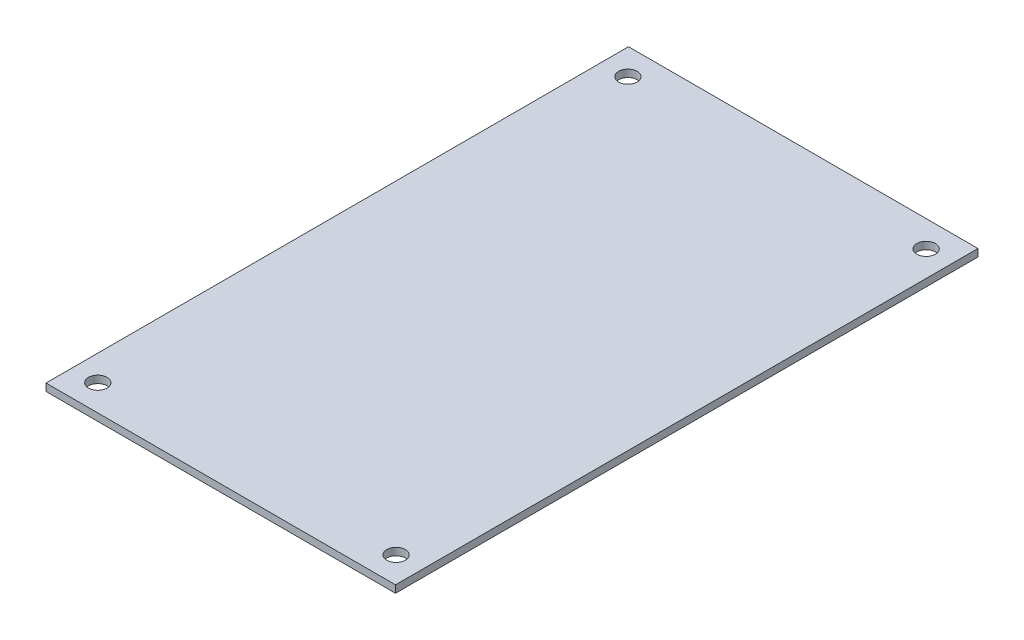
ISO-10303-21;
HEADER;
FILE_DESCRIPTION(('STEP AP214'),'2;1');
FILE_NAME('part.step','',(''),(''),'','','');
FILE_SCHEMA(('AUTOMOTIVE_DESIGN { 1 0 10303 214 1 1 1 1 }'));
ENDSEC;
DATA;
#1=APPLICATION_CONTEXT('core data for automotive mechanical design processes');
#2=APPLICATION_PROTOCOL_DEFINITION('international standard','automotive_design',2000,#1);
#3=PRODUCT_CONTEXT('',#1,'mechanical');
#4=PRODUCT('Part','Part','',(#3));
#5=PRODUCT_RELATED_PRODUCT_CATEGORY('part','',(#4));
#6=PRODUCT_DEFINITION_FORMATION('','',#4);
#7=PRODUCT_DEFINITION_CONTEXT('part definition',#1,'design');
#8=PRODUCT_DEFINITION('design','',#6,#7);
#9=PRODUCT_DEFINITION_SHAPE('','',#8);
#10=(LENGTH_UNIT() NAMED_UNIT(*) SI_UNIT(.MILLI.,.METRE.));
#11=(NAMED_UNIT(*) PLANE_ANGLE_UNIT() SI_UNIT($,.RADIAN.));
#12=(NAMED_UNIT(*) SI_UNIT($,.STERADIAN.) SOLID_ANGLE_UNIT());
#13=UNCERTAINTY_MEASURE_WITH_UNIT(LENGTH_MEASURE(1.E-05),#10,'distance_accuracy_value','');
#14=(GEOMETRIC_REPRESENTATION_CONTEXT(3) GLOBAL_UNCERTAINTY_ASSIGNED_CONTEXT((#13)) GLOBAL_UNIT_ASSIGNED_CONTEXT((#10,
#11,#12)) REPRESENTATION_CONTEXT('',''));
#15=CARTESIAN_POINT('',(0.,0.,0.));
#16=DIRECTION('',(0.,0.,1.));
#17=DIRECTION('',(1.,0.,0.));
#18=AXIS2_PLACEMENT_3D('',#15,#16,#17);
#19=CARTESIAN_POINT('',(38.0100000000001,-22.7500000000002,-0.00500000000001888));
#20=DIRECTION('',(0.,-1.,0.));
#21=DIRECTION('',(0.,0.,-1.));
#22=AXIS2_PLACEMENT_3D('',#19,#20,#21);
#23=PLANE('',#22);
#24=CARTESIAN_POINT('',(-32.6,-22.7500000000002,121.285));
#25=DIRECTION('',(0.,-1.,0.));
#26=DIRECTION('',(-1.,0.,0.));
#27=AXIS2_PLACEMENT_3D('',#24,#25,#26);
#28=CIRCLE('',#27,2.02500000000005);
#29=CARTESIAN_POINT('',(-34.625,-22.7500000000002,121.285));
#30=VERTEX_POINT('',#29);
#31=EDGE_CURVE('E93',#30,#30,#28,.T.);
#32=ORIENTED_EDGE('',*,*,#31,.F.);
#33=EDGE_LOOP('',(#32));
#34=FACE_BOUND('',#33,.T.);
#35=CARTESIAN_POINT('',(-32.6,-22.7500000000002,5.71499999999998));
#36=DIRECTION('',(0.,-1.,0.));
#37=DIRECTION('',(-1.,0.,0.));
#38=AXIS2_PLACEMENT_3D('',#35,#36,#37);
#39=CIRCLE('',#38,2.025);
#40=CARTESIAN_POINT('',(-34.625,-22.7500000000002,5.71499999999998));
#41=VERTEX_POINT('',#40);
#42=EDGE_CURVE('E95',#41,#41,#39,.T.);
#43=ORIENTED_EDGE('',*,*,#42,.F.);
#44=EDGE_LOOP('',(#43));
#45=FACE_BOUND('',#44,.T.);
#46=CARTESIAN_POINT('',(32.42,-22.7500000000002,5.71499999999998));
#47=DIRECTION('',(0.,-1.,0.));
#48=DIRECTION('',(-1.,0.,0.));
#49=AXIS2_PLACEMENT_3D('',#46,#47,#48);
#50=CIRCLE('',#49,2.025);
#51=CARTESIAN_POINT('',(30.395,-22.7500000000002,5.71499999999998));
#52=VERTEX_POINT('',#51);
#53=EDGE_CURVE('E109',#52,#52,#50,.T.);
#54=ORIENTED_EDGE('',*,*,#53,.F.);
#55=EDGE_LOOP('',(#54));
#56=FACE_BOUND('',#55,.T.);
#57=CARTESIAN_POINT('',(32.42,-22.7500000000002,121.285));
#58=DIRECTION('',(0.,-1.,0.));
#59=DIRECTION('',(-1.,0.,0.));
#60=AXIS2_PLACEMENT_3D('',#57,#58,#59);
#61=CIRCLE('',#60,2.02500000000005);
#62=CARTESIAN_POINT('',(30.395,-22.7500000000002,121.285));
#63=VERTEX_POINT('',#62);
#64=EDGE_CURVE('E112',#63,#63,#61,.T.);
#65=ORIENTED_EDGE('',*,*,#64,.F.);
#66=EDGE_LOOP('',(#65));
#67=FACE_BOUND('',#66,.T.);
#68=DIRECTION('',(1.,0.,0.));
#69=VECTOR('',#68,1.);
#70=CARTESIAN_POINT('',(-38.1899999999999,-22.7500000000002,-0.00500000000001888));
#71=LINE('',#70,#69);
#72=CARTESIAN_POINT('',(-38.1899999999999,-22.7500000000002,-0.00500000000001888));
#73=VERTEX_POINT('',#72);
#74=CARTESIAN_POINT('',(38.0100000000001,-22.7500000000002,-0.00500000000001888));
#75=VERTEX_POINT('',#74);
#76=EDGE_CURVE('E11',#73,#75,#71,.T.);
#77=ORIENTED_EDGE('',*,*,#76,.T.);
#78=DIRECTION('',(0.,0.,1.));
#79=VECTOR('',#78,1.);
#80=CARTESIAN_POINT('',(38.0100000000001,-22.7500000000002,-0.00500000000001888));
#81=LINE('',#80,#79);
#82=CARTESIAN_POINT('',(38.0100000000001,-22.7500000000002,126.995));
#83=VERTEX_POINT('',#82);
#84=EDGE_CURVE('E27',#75,#83,#81,.T.);
#85=ORIENTED_EDGE('',*,*,#84,.T.);
#86=DIRECTION('',(-1.,0.,0.));
#87=VECTOR('',#86,1.);
#88=CARTESIAN_POINT('',(38.0100000000001,-22.7500000000002,126.995));
#89=LINE('',#88,#87);
#90=CARTESIAN_POINT('',(-38.1899999999999,-22.7500000000002,126.995));
#91=VERTEX_POINT('',#90);
#92=EDGE_CURVE('E80',#83,#91,#89,.T.);
#93=ORIENTED_EDGE('',*,*,#92,.T.);
#94=DIRECTION('',(0.,0.,-1.));
#95=VECTOR('',#94,1.);
#96=CARTESIAN_POINT('',(-38.1899999999999,-22.7500000000002,126.995));
#97=LINE('',#96,#95);
#98=EDGE_CURVE('E84',#91,#73,#97,.T.);
#99=ORIENTED_EDGE('',*,*,#98,.T.);
#100=EDGE_LOOP('',(#77,#85,#93,#99));
#101=FACE_BOUND('',#100,.T.);
#102=ADVANCED_FACE('F17',(#34,#45,#56,#67,#101),#23,.T.);
#103=CARTESIAN_POINT('',(38.0100000000001,-21.1500000000002,-0.00500000000001888));
#104=DIRECTION('',(0.,1.,0.));
#105=DIRECTION('',(0.,0.,1.));
#106=AXIS2_PLACEMENT_3D('',#103,#104,#105);
#107=PLANE('',#106);
#108=CARTESIAN_POINT('',(-32.6,-21.1500000000002,121.285));
#109=DIRECTION('',(0.,-1.,0.));
#110=DIRECTION('',(-1.,0.,0.));
#111=AXIS2_PLACEMENT_3D('',#108,#109,#110);
#112=CIRCLE('',#111,2.02500000000005);
#113=CARTESIAN_POINT('',(-34.625,-21.1500000000002,121.285));
#114=VERTEX_POINT('',#113);
#115=EDGE_CURVE('E91',#114,#114,#112,.T.);
#116=ORIENTED_EDGE('',*,*,#115,.T.);
#117=EDGE_LOOP('',(#116));
#118=FACE_BOUND('',#117,.T.);
#119=CARTESIAN_POINT('',(-32.6,-21.1500000000002,5.71499999999998));
#120=DIRECTION('',(0.,-1.,0.));
#121=DIRECTION('',(-1.,0.,0.));
#122=AXIS2_PLACEMENT_3D('',#119,#120,#121);
#123=CIRCLE('',#122,2.025);
#124=CARTESIAN_POINT('',(-34.625,-21.1500000000002,5.71499999999998));
#125=VERTEX_POINT('',#124);
#126=EDGE_CURVE('E96',#125,#125,#123,.T.);
#127=ORIENTED_EDGE('',*,*,#126,.T.);
#128=EDGE_LOOP('',(#127));
#129=FACE_BOUND('',#128,.T.);
#130=CARTESIAN_POINT('',(32.42,-21.1500000000002,5.71499999999998));
#131=DIRECTION('',(0.,-1.,0.));
#132=DIRECTION('',(-1.,0.,0.));
#133=AXIS2_PLACEMENT_3D('',#130,#131,#132);
#134=CIRCLE('',#133,2.025);
#135=CARTESIAN_POINT('',(30.395,-21.1500000000002,5.71499999999998));
#136=VERTEX_POINT('',#135);
#137=EDGE_CURVE('E98',#136,#136,#134,.T.);
#138=ORIENTED_EDGE('',*,*,#137,.T.);
#139=EDGE_LOOP('',(#138));
#140=FACE_BOUND('',#139,.T.);
#141=CARTESIAN_POINT('',(32.42,-21.1500000000002,121.285));
#142=DIRECTION('',(0.,-1.,0.));
#143=DIRECTION('',(-1.,0.,0.));
#144=AXIS2_PLACEMENT_3D('',#141,#142,#143);
#145=CIRCLE('',#144,2.02500000000005);
#146=CARTESIAN_POINT('',(30.395,-21.1500000000002,121.285));
#147=VERTEX_POINT('',#146);
#148=EDGE_CURVE('E76',#147,#147,#145,.T.);
#149=ORIENTED_EDGE('',*,*,#148,.T.);
#150=EDGE_LOOP('',(#149));
#151=FACE_BOUND('',#150,.T.);
#152=DIRECTION('',(1.,0.,0.));
#153=VECTOR('',#152,1.);
#154=CARTESIAN_POINT('',(-38.1899999999999,-21.1500000000002,-0.00500000000001888));
#155=LINE('',#154,#153);
#156=CARTESIAN_POINT('',(-38.1899999999999,-21.1500000000002,-0.00500000000001888));
#157=VERTEX_POINT('',#156);
#158=CARTESIAN_POINT('',(38.0100000000001,-21.1500000000002,-0.00500000000001888));
#159=VERTEX_POINT('',#158);
#160=EDGE_CURVE('E21',#157,#159,#155,.T.);
#161=ORIENTED_EDGE('',*,*,#160,.F.);
#162=DIRECTION('',(0.,0.,-1.));
#163=VECTOR('',#162,1.);
#164=CARTESIAN_POINT('',(-38.1899999999999,-21.1500000000002,126.995));
#165=LINE('',#164,#163);
#166=CARTESIAN_POINT('',(-38.1899999999999,-21.1500000000002,126.995));
#167=VERTEX_POINT('',#166);
#168=EDGE_CURVE('E68',#167,#157,#165,.T.);
#169=ORIENTED_EDGE('',*,*,#168,.F.);
#170=DIRECTION('',(-1.,0.,0.));
#171=VECTOR('',#170,1.);
#172=CARTESIAN_POINT('',(38.0100000000001,-21.1500000000002,126.995));
#173=LINE('',#172,#171);
#174=CARTESIAN_POINT('',(38.0100000000001,-21.1500000000002,126.995));
#175=VERTEX_POINT('',#174);
#176=EDGE_CURVE('E63',#175,#167,#173,.T.);
#177=ORIENTED_EDGE('',*,*,#176,.F.);
#178=DIRECTION('',(0.,0.,1.));
#179=VECTOR('',#178,1.);
#180=CARTESIAN_POINT('',(38.0100000000001,-21.1500000000002,-0.00500000000001888));
#181=LINE('',#180,#179);
#182=EDGE_CURVE('E67',#159,#175,#181,.T.);
#183=ORIENTED_EDGE('',*,*,#182,.F.);
#184=EDGE_LOOP('',(#161,#169,#177,#183));
#185=FACE_BOUND('',#184,.T.);
#186=ADVANCED_FACE('F66',(#118,#129,#140,#151,#185),#107,.T.);
#187=CARTESIAN_POINT('',(38.0100000000001,-21.1500000000002,-0.00500000000001888));
#188=DIRECTION('',(1.,0.,0.));
#189=DIRECTION('',(0.,0.,-1.));
#190=AXIS2_PLACEMENT_3D('',#187,#188,#189);
#191=PLANE('',#190);
#192=ORIENTED_EDGE('',*,*,#84,.F.);
#193=DIRECTION('',(0.,-1.,0.));
#194=VECTOR('',#193,1.);
#195=CARTESIAN_POINT('',(38.0100000000001,-21.1500000000002,-0.00500000000001888));
#196=LINE('',#195,#194);
#197=EDGE_CURVE('E36',#159,#75,#196,.T.);
#198=ORIENTED_EDGE('',*,*,#197,.F.);
#199=ORIENTED_EDGE('',*,*,#182,.T.);
#200=DIRECTION('',(0.,-1.,0.));
#201=VECTOR('',#200,1.);
#202=CARTESIAN_POINT('',(38.0100000000001,-21.1500000000002,126.995));
#203=LINE('',#202,#201);
#204=EDGE_CURVE('E71',#175,#83,#203,.T.);
#205=ORIENTED_EDGE('',*,*,#204,.T.);
#206=EDGE_LOOP('',(#192,#198,#199,#205));
#207=FACE_BOUND('',#206,.T.);
#208=ADVANCED_FACE('F75',(#207),#191,.T.);
#209=CARTESIAN_POINT('',(38.0100000000001,-21.1500000000002,126.995));
#210=DIRECTION('',(0.,0.,1.));
#211=DIRECTION('',(1.,0.,0.));
#212=AXIS2_PLACEMENT_3D('',#209,#210,#211);
#213=PLANE('',#212);
#214=ORIENTED_EDGE('',*,*,#92,.F.);
#215=ORIENTED_EDGE('',*,*,#204,.F.);
#216=ORIENTED_EDGE('',*,*,#176,.T.);
#217=DIRECTION('',(0.,-1.,0.));
#218=VECTOR('',#217,1.);
#219=CARTESIAN_POINT('',(-38.1899999999999,-21.1500000000002,126.995));
#220=LINE('',#219,#218);
#221=EDGE_CURVE('E56',#167,#91,#220,.T.);
#222=ORIENTED_EDGE('',*,*,#221,.T.);
#223=EDGE_LOOP('',(#214,#215,#216,#222));
#224=FACE_BOUND('',#223,.T.);
#225=ADVANCED_FACE('F78',(#224),#213,.T.);
#226=CARTESIAN_POINT('',(-38.1899999999999,-21.1500000000002,126.995));
#227=DIRECTION('',(-1.,0.,0.));
#228=DIRECTION('',(0.,0.,1.));
#229=AXIS2_PLACEMENT_3D('',#226,#227,#228);
#230=PLANE('',#229);
#231=ORIENTED_EDGE('',*,*,#98,.F.);
#232=ORIENTED_EDGE('',*,*,#221,.F.);
#233=ORIENTED_EDGE('',*,*,#168,.T.);
#234=DIRECTION('',(0.,-1.,0.));
#235=VECTOR('',#234,1.);
#236=CARTESIAN_POINT('',(-38.1899999999999,-21.1500000000002,-0.00500000000001888));
#237=LINE('',#236,#235);
#238=EDGE_CURVE('E50',#157,#73,#237,.T.);
#239=ORIENTED_EDGE('',*,*,#238,.T.);
#240=EDGE_LOOP('',(#231,#232,#233,#239));
#241=FACE_BOUND('',#240,.T.);
#242=ADVANCED_FACE('F129',(#241),#230,.T.);
#243=CARTESIAN_POINT('',(-38.1899999999999,-21.1500000000002,-0.00500000000001888));
#244=DIRECTION('',(0.,0.,-1.));
#245=DIRECTION('',(-1.,0.,0.));
#246=AXIS2_PLACEMENT_3D('',#243,#244,#245);
#247=PLANE('',#246);
#248=ORIENTED_EDGE('',*,*,#76,.F.);
#249=ORIENTED_EDGE('',*,*,#238,.F.);
#250=ORIENTED_EDGE('',*,*,#160,.T.);
#251=ORIENTED_EDGE('',*,*,#197,.T.);
#252=EDGE_LOOP('',(#248,#249,#250,#251));
#253=FACE_BOUND('',#252,.T.);
#254=ADVANCED_FACE('F126',(#253),#247,.T.);
#255=CARTESIAN_POINT('',(-32.6,-21.1500000000002,121.285));
#256=DIRECTION('',(0.,1.,0.));
#257=DIRECTION('',(0.,0.,1.));
#258=AXIS2_PLACEMENT_3D('',#255,#256,#257);
#259=CYLINDRICAL_SURFACE('',#258,2.02500000000005);
#260=ORIENTED_EDGE('',*,*,#31,.T.);
#261=EDGE_LOOP('',(#260));
#262=FACE_BOUND('',#261,.T.);
#263=ORIENTED_EDGE('',*,*,#115,.F.);
#264=EDGE_LOOP('',(#263));
#265=FACE_BOUND('',#264,.T.);
#266=ADVANCED_FACE('F128',(#262,#265),#259,.F.);
#267=CARTESIAN_POINT('',(-32.6,-21.1500000000002,5.71499999999998));
#268=DIRECTION('',(0.,1.,0.));
#269=DIRECTION('',(0.,0.,1.));
#270=AXIS2_PLACEMENT_3D('',#267,#268,#269);
#271=CYLINDRICAL_SURFACE('',#270,2.025);
#272=ORIENTED_EDGE('',*,*,#42,.T.);
#273=EDGE_LOOP('',(#272));
#274=FACE_BOUND('',#273,.T.);
#275=ORIENTED_EDGE('',*,*,#126,.F.);
#276=EDGE_LOOP('',(#275));
#277=FACE_BOUND('',#276,.T.);
#278=ADVANCED_FACE('F136',(#274,#277),#271,.F.);
#279=CARTESIAN_POINT('',(32.42,-21.1500000000002,5.71499999999998));
#280=DIRECTION('',(0.,1.,0.));
#281=DIRECTION('',(0.,0.,1.));
#282=AXIS2_PLACEMENT_3D('',#279,#280,#281);
#283=CYLINDRICAL_SURFACE('',#282,2.025);
#284=ORIENTED_EDGE('',*,*,#53,.T.);
#285=EDGE_LOOP('',(#284));
#286=FACE_BOUND('',#285,.T.);
#287=ORIENTED_EDGE('',*,*,#137,.F.);
#288=EDGE_LOOP('',(#287));
#289=FACE_BOUND('',#288,.T.);
#290=ADVANCED_FACE('F143',(#286,#289),#283,.F.);
#291=CARTESIAN_POINT('',(32.42,-21.1500000000002,121.285));
#292=DIRECTION('',(0.,1.,0.));
#293=DIRECTION('',(0.,0.,1.));
#294=AXIS2_PLACEMENT_3D('',#291,#292,#293);
#295=CYLINDRICAL_SURFACE('',#294,2.02500000000005);
#296=ORIENTED_EDGE('',*,*,#64,.T.);
#297=EDGE_LOOP('',(#296));
#298=FACE_BOUND('',#297,.T.);
#299=ORIENTED_EDGE('',*,*,#148,.F.);
#300=EDGE_LOOP('',(#299));
#301=FACE_BOUND('',#300,.T.);
#302=ADVANCED_FACE('F19',(#298,#301),#295,.F.);
#303=CLOSED_SHELL('',(#102,#186,#208,#225,#242,#254,#266,#278,#290,#302));
#304=MANIFOLD_SOLID_BREP('B1',#303);
#305=ADVANCED_BREP_SHAPE_REPRESENTATION('',(#18,#304),#14);
#306=SHAPE_DEFINITION_REPRESENTATION(#9,#305);
ENDSEC;
END-ISO-10303-21;
